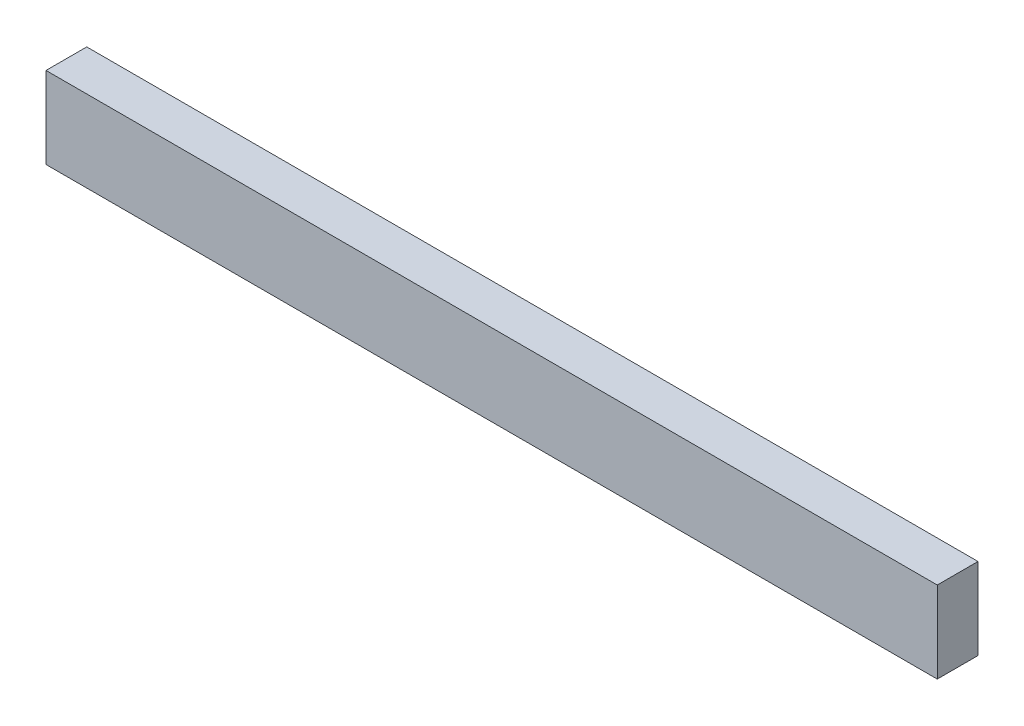
ISO-10303-21;
HEADER;
FILE_DESCRIPTION(('STEP AP214'),'2;1');
FILE_NAME('part.step','',(''),(''),'','','');
FILE_SCHEMA(('AUTOMOTIVE_DESIGN { 1 0 10303 214 1 1 1 1 }'));
ENDSEC;
DATA;
#1=APPLICATION_CONTEXT('core data for automotive mechanical design processes');
#2=APPLICATION_PROTOCOL_DEFINITION('international standard','automotive_design',2000,#1);
#3=PRODUCT_CONTEXT('',#1,'mechanical');
#4=PRODUCT('Part','Part','',(#3));
#5=PRODUCT_RELATED_PRODUCT_CATEGORY('part','',(#4));
#6=PRODUCT_DEFINITION_FORMATION('','',#4);
#7=PRODUCT_DEFINITION_CONTEXT('part definition',#1,'design');
#8=PRODUCT_DEFINITION('design','',#6,#7);
#9=PRODUCT_DEFINITION_SHAPE('','',#8);
#10=(LENGTH_UNIT() NAMED_UNIT(*) SI_UNIT(.MILLI.,.METRE.));
#11=(NAMED_UNIT(*) PLANE_ANGLE_UNIT() SI_UNIT($,.RADIAN.));
#12=(NAMED_UNIT(*) SI_UNIT($,.STERADIAN.) SOLID_ANGLE_UNIT());
#13=UNCERTAINTY_MEASURE_WITH_UNIT(LENGTH_MEASURE(1.E-05),#10,'distance_accuracy_value','');
#14=(GEOMETRIC_REPRESENTATION_CONTEXT(3) GLOBAL_UNCERTAINTY_ASSIGNED_CONTEXT((#13)) GLOBAL_UNIT_ASSIGNED_CONTEXT((#10,
#11,#12)) REPRESENTATION_CONTEXT('',''));
#15=CARTESIAN_POINT('',(0.,0.,0.));
#16=DIRECTION('',(0.,0.,1.));
#17=DIRECTION('',(1.,0.,0.));
#18=AXIS2_PLACEMENT_3D('',#15,#16,#17);
#19=CARTESIAN_POINT('',(0.,0.,25.4));
#20=DIRECTION('',(1.,0.,0.));
#21=DIRECTION('',(0.,0.,-1.));
#22=AXIS2_PLACEMENT_3D('',#19,#20,#21);
#23=PLANE('',#22);
#24=DIRECTION('',(0.,-1.,0.));
#25=VECTOR('',#24,1.);
#26=CARTESIAN_POINT('',(0.,0.,0.));
#27=LINE('',#26,#25);
#28=CARTESIAN_POINT('',(0.,50.8,0.));
#29=VERTEX_POINT('',#28);
#30=CARTESIAN_POINT('',(0.,0.,0.));
#31=VERTEX_POINT('',#30);
#32=EDGE_CURVE('E96',#29,#31,#27,.T.);
#33=ORIENTED_EDGE('',*,*,#32,.T.);
#34=DIRECTION('',(0.,0.,-1.));
#35=VECTOR('',#34,1.);
#36=CARTESIAN_POINT('',(0.,0.,25.4));
#37=LINE('',#36,#35);
#38=CARTESIAN_POINT('',(0.,0.,25.4));
#39=VERTEX_POINT('',#38);
#40=EDGE_CURVE('E11',#39,#31,#37,.T.);
#41=ORIENTED_EDGE('',*,*,#40,.F.);
#42=DIRECTION('',(0.,-1.,0.));
#43=VECTOR('',#42,1.);
#44=CARTESIAN_POINT('',(0.,0.,25.4));
#45=LINE('',#44,#43);
#46=CARTESIAN_POINT('',(0.,50.8,25.4));
#47=VERTEX_POINT('',#46);
#48=EDGE_CURVE('E84',#47,#39,#45,.T.);
#49=ORIENTED_EDGE('',*,*,#48,.F.);
#50=DIRECTION('',(0.,0.,-1.));
#51=VECTOR('',#50,1.);
#52=CARTESIAN_POINT('',(0.,50.8,25.4));
#53=LINE('',#52,#51);
#54=EDGE_CURVE('E92',#47,#29,#53,.T.);
#55=ORIENTED_EDGE('',*,*,#54,.T.);
#56=EDGE_LOOP('',(#33,#41,#49,#55));
#57=FACE_BOUND('',#56,.T.);
#58=ADVANCED_FACE('F33',(#57),#23,.F.);
#59=CARTESIAN_POINT('',(0.,0.,25.4));
#60=DIRECTION('',(0.,1.,0.));
#61=DIRECTION('',(0.,0.,1.));
#62=AXIS2_PLACEMENT_3D('',#59,#60,#61);
#63=PLANE('',#62);
#64=DIRECTION('',(1.,0.,0.));
#65=VECTOR('',#64,1.);
#66=CARTESIAN_POINT('',(0.,0.,0.));
#67=LINE('',#66,#65);
#68=CARTESIAN_POINT('',(555.625,0.,0.));
#69=VERTEX_POINT('',#68);
#70=EDGE_CURVE('E88',#31,#69,#67,.T.);
#71=ORIENTED_EDGE('',*,*,#70,.T.);
#72=DIRECTION('',(0.,0.,-1.));
#73=VECTOR('',#72,1.);
#74=CARTESIAN_POINT('',(555.625,0.,25.4));
#75=LINE('',#74,#73);
#76=CARTESIAN_POINT('',(555.625,0.,25.4));
#77=VERTEX_POINT('',#76);
#78=EDGE_CURVE('E41',#77,#69,#75,.T.);
#79=ORIENTED_EDGE('',*,*,#78,.F.);
#80=DIRECTION('',(1.,0.,0.));
#81=VECTOR('',#80,1.);
#82=CARTESIAN_POINT('',(0.,0.,25.4));
#83=LINE('',#82,#81);
#84=EDGE_CURVE('E79',#39,#77,#83,.T.);
#85=ORIENTED_EDGE('',*,*,#84,.F.);
#86=ORIENTED_EDGE('',*,*,#40,.T.);
#87=EDGE_LOOP('',(#71,#79,#85,#86));
#88=FACE_BOUND('',#87,.T.);
#89=ADVANCED_FACE('F87',(#88),#63,.F.);
#90=CARTESIAN_POINT('',(555.625,0.,25.4));
#91=DIRECTION('',(-1.,0.,0.));
#92=DIRECTION('',(0.,0.,1.));
#93=AXIS2_PLACEMENT_3D('',#90,#91,#92);
#94=PLANE('',#93);
#95=DIRECTION('',(0.,1.,0.));
#96=VECTOR('',#95,1.);
#97=CARTESIAN_POINT('',(555.625,0.,0.));
#98=LINE('',#97,#96);
#99=CARTESIAN_POINT('',(555.625,50.8,0.));
#100=VERTEX_POINT('',#99);
#101=EDGE_CURVE('E66',#69,#100,#98,.T.);
#102=ORIENTED_EDGE('',*,*,#101,.T.);
#103=DIRECTION('',(0.,0.,-1.));
#104=VECTOR('',#103,1.);
#105=CARTESIAN_POINT('',(555.625,50.8,25.4));
#106=LINE('',#105,#104);
#107=CARTESIAN_POINT('',(555.625,50.8,25.4));
#108=VERTEX_POINT('',#107);
#109=EDGE_CURVE('E89',#108,#100,#106,.T.);
#110=ORIENTED_EDGE('',*,*,#109,.F.);
#111=DIRECTION('',(0.,1.,0.));
#112=VECTOR('',#111,1.);
#113=CARTESIAN_POINT('',(555.625,0.,25.4));
#114=LINE('',#113,#112);
#115=EDGE_CURVE('E82',#77,#108,#114,.T.);
#116=ORIENTED_EDGE('',*,*,#115,.F.);
#117=ORIENTED_EDGE('',*,*,#78,.T.);
#118=EDGE_LOOP('',(#102,#110,#116,#117));
#119=FACE_BOUND('',#118,.T.);
#120=ADVANCED_FACE('F90',(#119),#94,.F.);
#121=CARTESIAN_POINT('',(0.,50.8,25.4));
#122=DIRECTION('',(0.,-1.,0.));
#123=DIRECTION('',(0.,0.,-1.));
#124=AXIS2_PLACEMENT_3D('',#121,#122,#123);
#125=PLANE('',#124);
#126=DIRECTION('',(-1.,0.,0.));
#127=VECTOR('',#126,1.);
#128=CARTESIAN_POINT('',(0.,50.8,0.));
#129=LINE('',#128,#127);
#130=EDGE_CURVE('E72',#100,#29,#129,.T.);
#131=ORIENTED_EDGE('',*,*,#130,.T.);
#132=ORIENTED_EDGE('',*,*,#54,.F.);
#133=DIRECTION('',(-1.,0.,0.));
#134=VECTOR('',#133,1.);
#135=CARTESIAN_POINT('',(0.,50.8,25.4));
#136=LINE('',#135,#134);
#137=EDGE_CURVE('E49',#108,#47,#136,.T.);
#138=ORIENTED_EDGE('',*,*,#137,.F.);
#139=ORIENTED_EDGE('',*,*,#109,.T.);
#140=EDGE_LOOP('',(#131,#132,#138,#139));
#141=FACE_BOUND('',#140,.T.);
#142=ADVANCED_FACE('F103',(#141),#125,.F.);
#143=CARTESIAN_POINT('',(0.,0.,25.4));
#144=DIRECTION('',(0.,0.,-1.));
#145=DIRECTION('',(-1.,0.,0.));
#146=AXIS2_PLACEMENT_3D('',#143,#144,#145);
#147=PLANE('',#146);
#148=ORIENTED_EDGE('',*,*,#48,.T.);
#149=ORIENTED_EDGE('',*,*,#84,.T.);
#150=ORIENTED_EDGE('',*,*,#115,.T.);
#151=ORIENTED_EDGE('',*,*,#137,.T.);
#152=EDGE_LOOP('',(#148,#149,#150,#151));
#153=FACE_BOUND('',#152,.T.);
#154=ADVANCED_FACE('F80',(#153),#147,.F.);
#155=CARTESIAN_POINT('',(0.,0.,0.));
#156=DIRECTION('',(0.,0.,-1.));
#157=DIRECTION('',(-1.,0.,0.));
#158=AXIS2_PLACEMENT_3D('',#155,#156,#157);
#159=PLANE('',#158);
#160=ORIENTED_EDGE('',*,*,#32,.F.);
#161=ORIENTED_EDGE('',*,*,#130,.F.);
#162=ORIENTED_EDGE('',*,*,#101,.F.);
#163=ORIENTED_EDGE('',*,*,#70,.F.);
#164=EDGE_LOOP('',(#160,#161,#162,#163));
#165=FACE_BOUND('',#164,.T.);
#166=ADVANCED_FACE('F106',(#165),#159,.T.);
#167=CLOSED_SHELL('',(#58,#89,#120,#142,#154,#166));
#168=MANIFOLD_SOLID_BREP('B2',#167);
#169=ADVANCED_BREP_SHAPE_REPRESENTATION('',(#18,#168),#14);
#170=SHAPE_DEFINITION_REPRESENTATION(#9,#169);
ENDSEC;
END-ISO-10303-21;
